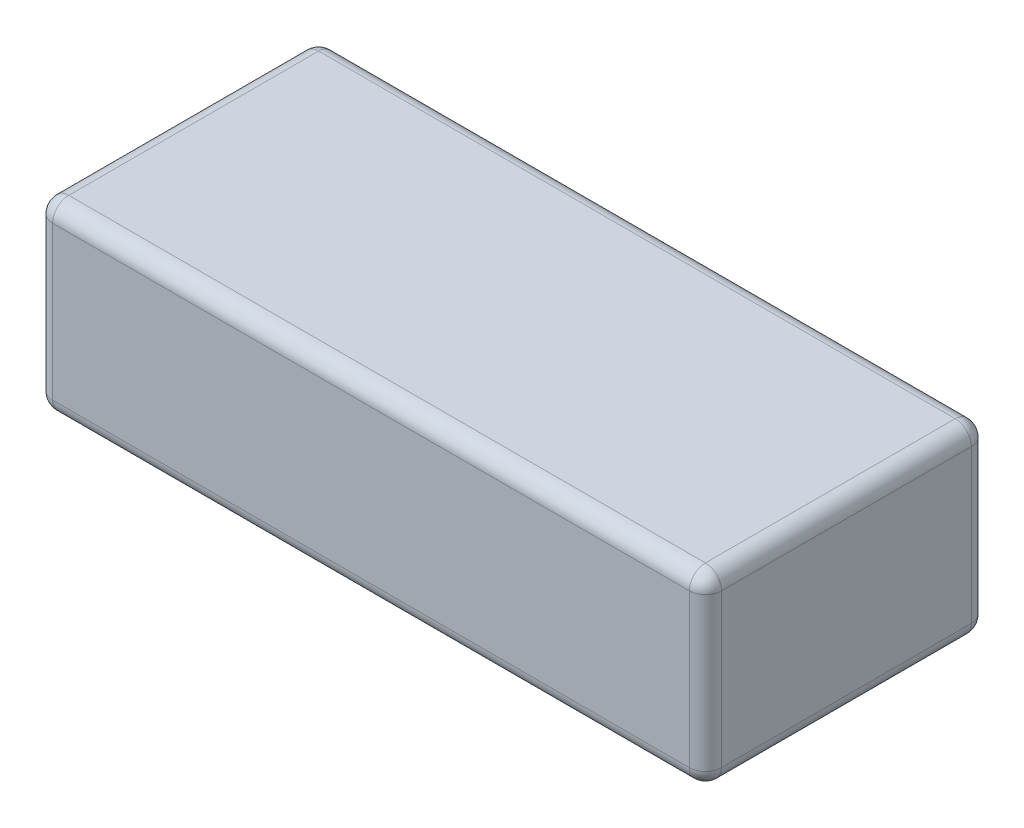
ISO-10303-21;
HEADER;
FILE_DESCRIPTION(('STEP AP214'),'2;1');
FILE_NAME('part.step','',(''),(''),'','','');
FILE_SCHEMA(('AUTOMOTIVE_DESIGN { 1 0 10303 214 1 1 1 1 }'));
ENDSEC;
DATA;
#1=APPLICATION_CONTEXT('core data for automotive mechanical design processes');
#2=APPLICATION_PROTOCOL_DEFINITION('international standard','automotive_design',2000,#1);
#3=PRODUCT_CONTEXT('',#1,'mechanical');
#4=PRODUCT('Part','Part','',(#3));
#5=PRODUCT_RELATED_PRODUCT_CATEGORY('part','',(#4));
#6=PRODUCT_DEFINITION_FORMATION('','',#4);
#7=PRODUCT_DEFINITION_CONTEXT('part definition',#1,'design');
#8=PRODUCT_DEFINITION('design','',#6,#7);
#9=PRODUCT_DEFINITION_SHAPE('','',#8);
#10=(LENGTH_UNIT() NAMED_UNIT(*) SI_UNIT(.MILLI.,.METRE.));
#11=(NAMED_UNIT(*) PLANE_ANGLE_UNIT() SI_UNIT($,.RADIAN.));
#12=(NAMED_UNIT(*) SI_UNIT($,.STERADIAN.) SOLID_ANGLE_UNIT());
#13=UNCERTAINTY_MEASURE_WITH_UNIT(LENGTH_MEASURE(1.E-05),#10,'distance_accuracy_value','');
#14=(GEOMETRIC_REPRESENTATION_CONTEXT(3) GLOBAL_UNCERTAINTY_ASSIGNED_CONTEXT((#13)) GLOBAL_UNIT_ASSIGNED_CONTEXT((#10,
#11,#12)) REPRESENTATION_CONTEXT('',''));
#15=CARTESIAN_POINT('',(0.,0.,0.));
#16=DIRECTION('',(0.,0.,1.));
#17=DIRECTION('',(1.,0.,0.));
#18=AXIS2_PLACEMENT_3D('',#15,#16,#17);
#19=CARTESIAN_POINT('',(41.5,23.,17.5));
#20=DIRECTION('',(-1.,0.,0.));
#21=DIRECTION('',(0.,0.,1.));
#22=AXIS2_PLACEMENT_3D('',#19,#20,#21);
#23=PLANE('',#22);
#24=DIRECTION('',(0.,-1.,0.));
#25=VECTOR('',#24,1.);
#26=CARTESIAN_POINT('',(41.5,23.,15.5));
#27=LINE('',#26,#25);
#28=CARTESIAN_POINT('',(41.5,21.,15.5));
#29=VERTEX_POINT('',#28);
#30=CARTESIAN_POINT('',(41.5,2.,15.5));
#31=VERTEX_POINT('',#30);
#32=EDGE_CURVE('E159',#29,#31,#27,.T.);
#33=ORIENTED_EDGE('',*,*,#32,.T.);
#34=DIRECTION('',(0.,0.,-1.));
#35=VECTOR('',#34,1.);
#36=CARTESIAN_POINT('',(41.5,2.,-17.5));
#37=LINE('',#36,#35);
#38=CARTESIAN_POINT('',(41.5,2.,-15.5));
#39=VERTEX_POINT('',#38);
#40=EDGE_CURVE('E132',#31,#39,#37,.T.);
#41=ORIENTED_EDGE('',*,*,#40,.T.);
#42=DIRECTION('',(0.,-1.,0.));
#43=VECTOR('',#42,1.);
#44=CARTESIAN_POINT('',(41.5,23.,-15.5));
#45=LINE('',#44,#43);
#46=CARTESIAN_POINT('',(41.5,21.,-15.5));
#47=VERTEX_POINT('',#46);
#48=EDGE_CURVE('E150',#39,#47,#45,.F.);
#49=ORIENTED_EDGE('',*,*,#48,.T.);
#50=DIRECTION('',(0.,0.,-1.));
#51=VECTOR('',#50,1.);
#52=CARTESIAN_POINT('',(41.5,21.,17.5));
#53=LINE('',#52,#51);
#54=EDGE_CURVE('E156',#47,#29,#53,.F.);
#55=ORIENTED_EDGE('',*,*,#54,.T.);
#56=EDGE_LOOP('',(#33,#41,#49,#55));
#57=FACE_BOUND('',#56,.T.);
#58=ADVANCED_FACE('F34',(#57),#23,.F.);
#59=CARTESIAN_POINT('',(-41.5,23.,-17.5));
#60=DIRECTION('',(0.,0.,1.));
#61=DIRECTION('',(1.,0.,0.));
#62=AXIS2_PLACEMENT_3D('',#59,#60,#61);
#63=PLANE('',#62);
#64=DIRECTION('',(-1.,0.,0.));
#65=VECTOR('',#64,1.);
#66=CARTESIAN_POINT('',(-41.5,21.,-17.5));
#67=LINE('',#66,#65);
#68=CARTESIAN_POINT('',(-39.5,21.,-17.5));
#69=VERTEX_POINT('',#68);
#70=CARTESIAN_POINT('',(39.5,21.,-17.5));
#71=VERTEX_POINT('',#70);
#72=EDGE_CURVE('E194',#69,#71,#67,.F.);
#73=ORIENTED_EDGE('',*,*,#72,.T.);
#74=DIRECTION('',(0.,-1.,0.));
#75=VECTOR('',#74,1.);
#76=CARTESIAN_POINT('',(39.5,23.,-17.5));
#77=LINE('',#76,#75);
#78=CARTESIAN_POINT('',(39.5,2.,-17.5));
#79=VERTEX_POINT('',#78);
#80=EDGE_CURVE('E196',#71,#79,#77,.T.);
#81=ORIENTED_EDGE('',*,*,#80,.T.);
#82=DIRECTION('',(-1.,0.,0.));
#83=VECTOR('',#82,1.);
#84=CARTESIAN_POINT('',(-41.5,2.,-17.5));
#85=LINE('',#84,#83);
#86=CARTESIAN_POINT('',(-39.5,2.,-17.5));
#87=VERTEX_POINT('',#86);
#88=EDGE_CURVE('E192',#79,#87,#85,.T.);
#89=ORIENTED_EDGE('',*,*,#88,.T.);
#90=DIRECTION('',(0.,-1.,0.));
#91=VECTOR('',#90,1.);
#92=CARTESIAN_POINT('',(-39.5,23.,-17.5));
#93=LINE('',#92,#91);
#94=EDGE_CURVE('E190',#87,#69,#93,.F.);
#95=ORIENTED_EDGE('',*,*,#94,.T.);
#96=EDGE_LOOP('',(#73,#81,#89,#95));
#97=FACE_BOUND('',#96,.T.);
#98=ADVANCED_FACE('F327',(#97),#63,.F.);
#99=CARTESIAN_POINT('',(-41.5,23.,17.5));
#100=DIRECTION('',(1.,0.,0.));
#101=DIRECTION('',(0.,0.,-1.));
#102=AXIS2_PLACEMENT_3D('',#99,#100,#101);
#103=PLANE('',#102);
#104=DIRECTION('',(0.,0.,1.));
#105=VECTOR('',#104,1.);
#106=CARTESIAN_POINT('',(-41.5,21.,17.5));
#107=LINE('',#106,#105);
#108=CARTESIAN_POINT('',(-41.5,21.,15.5));
#109=VERTEX_POINT('',#108);
#110=CARTESIAN_POINT('',(-41.5,21.,-15.5));
#111=VERTEX_POINT('',#110);
#112=EDGE_CURVE('E58',#109,#111,#107,.F.);
#113=ORIENTED_EDGE('',*,*,#112,.T.);
#114=DIRECTION('',(0.,-1.,0.));
#115=VECTOR('',#114,1.);
#116=CARTESIAN_POINT('',(-41.5,23.,-15.5));
#117=LINE('',#116,#115);
#118=CARTESIAN_POINT('',(-41.5,2.,-15.5));
#119=VERTEX_POINT('',#118);
#120=EDGE_CURVE('E11',#111,#119,#117,.T.);
#121=ORIENTED_EDGE('',*,*,#120,.T.);
#122=DIRECTION('',(0.,0.,1.));
#123=VECTOR('',#122,1.);
#124=CARTESIAN_POINT('',(-41.5,2.,17.5));
#125=LINE('',#124,#123);
#126=CARTESIAN_POINT('',(-41.5,2.,15.5));
#127=VERTEX_POINT('',#126);
#128=EDGE_CURVE('E43',#119,#127,#125,.T.);
#129=ORIENTED_EDGE('',*,*,#128,.T.);
#130=DIRECTION('',(0.,-1.,0.));
#131=VECTOR('',#130,1.);
#132=CARTESIAN_POINT('',(-41.5,23.,15.5));
#133=LINE('',#132,#131);
#134=EDGE_CURVE('E199',#127,#109,#133,.F.);
#135=ORIENTED_EDGE('',*,*,#134,.T.);
#136=EDGE_LOOP('',(#113,#121,#129,#135));
#137=FACE_BOUND('',#136,.T.);
#138=ADVANCED_FACE('F299',(#137),#103,.F.);
#139=CARTESIAN_POINT('',(-41.5,23.,17.5));
#140=DIRECTION('',(0.,0.,-1.));
#141=DIRECTION('',(-1.,0.,0.));
#142=AXIS2_PLACEMENT_3D('',#139,#140,#141);
#143=PLANE('',#142);
#144=DIRECTION('',(0.,-1.,0.));
#145=VECTOR('',#144,1.);
#146=CARTESIAN_POINT('',(-39.5,23.,17.5));
#147=LINE('',#146,#145);
#148=CARTESIAN_POINT('',(-39.5,21.,17.5));
#149=VERTEX_POINT('',#148);
#150=CARTESIAN_POINT('',(-39.5,2.,17.5));
#151=VERTEX_POINT('',#150);
#152=EDGE_CURVE('E174',#149,#151,#147,.T.);
#153=ORIENTED_EDGE('',*,*,#152,.T.);
#154=DIRECTION('',(1.,0.,0.));
#155=VECTOR('',#154,1.);
#156=CARTESIAN_POINT('',(41.5,2.,17.5));
#157=LINE('',#156,#155);
#158=CARTESIAN_POINT('',(39.5,2.,17.5));
#159=VERTEX_POINT('',#158);
#160=EDGE_CURVE('E179',#151,#159,#157,.T.);
#161=ORIENTED_EDGE('',*,*,#160,.T.);
#162=DIRECTION('',(0.,-1.,0.));
#163=VECTOR('',#162,1.);
#164=CARTESIAN_POINT('',(39.5,23.,17.5));
#165=LINE('',#164,#163);
#166=CARTESIAN_POINT('',(39.5,21.,17.5));
#167=VERTEX_POINT('',#166);
#168=EDGE_CURVE('E176',#159,#167,#165,.F.);
#169=ORIENTED_EDGE('',*,*,#168,.T.);
#170=DIRECTION('',(1.,0.,0.));
#171=VECTOR('',#170,1.);
#172=CARTESIAN_POINT('',(-41.5,21.,17.5));
#173=LINE('',#172,#171);
#174=EDGE_CURVE('E172',#167,#149,#173,.F.);
#175=ORIENTED_EDGE('',*,*,#174,.T.);
#176=EDGE_LOOP('',(#153,#161,#169,#175));
#177=FACE_BOUND('',#176,.T.);
#178=ADVANCED_FACE('F272',(#177),#143,.F.);
#179=CARTESIAN_POINT('',(0.,23.,0.));
#180=DIRECTION('',(0.,-1.,0.));
#181=DIRECTION('',(0.,0.,-1.));
#182=AXIS2_PLACEMENT_3D('',#179,#180,#181);
#183=PLANE('',#182);
#184=DIRECTION('',(1.,0.,0.));
#185=VECTOR('',#184,1.);
#186=CARTESIAN_POINT('',(0.,23.,15.5));
#187=LINE('',#186,#185);
#188=CARTESIAN_POINT('',(-39.5,23.,15.5));
#189=VERTEX_POINT('',#188);
#190=CARTESIAN_POINT('',(39.5,23.,15.5));
#191=VERTEX_POINT('',#190);
#192=EDGE_CURVE('E181',#189,#191,#187,.T.);
#193=ORIENTED_EDGE('',*,*,#192,.T.);
#194=DIRECTION('',(0.,0.,-1.));
#195=VECTOR('',#194,1.);
#196=CARTESIAN_POINT('',(39.5,23.,0.));
#197=LINE('',#196,#195);
#198=CARTESIAN_POINT('',(39.5,23.,-15.5));
#199=VERTEX_POINT('',#198);
#200=EDGE_CURVE('E187',#191,#199,#197,.T.);
#201=ORIENTED_EDGE('',*,*,#200,.T.);
#202=DIRECTION('',(-1.,0.,0.));
#203=VECTOR('',#202,1.);
#204=CARTESIAN_POINT('',(0.,23.,-15.5));
#205=LINE('',#204,#203);
#206=CARTESIAN_POINT('',(-39.5,23.,-15.5));
#207=VERTEX_POINT('',#206);
#208=EDGE_CURVE('E185',#199,#207,#205,.T.);
#209=ORIENTED_EDGE('',*,*,#208,.T.);
#210=DIRECTION('',(0.,0.,1.));
#211=VECTOR('',#210,1.);
#212=CARTESIAN_POINT('',(-39.5,23.,0.));
#213=LINE('',#212,#211);
#214=EDGE_CURVE('E183',#207,#189,#213,.T.);
#215=ORIENTED_EDGE('',*,*,#214,.T.);
#216=EDGE_LOOP('',(#193,#201,#209,#215));
#217=FACE_BOUND('',#216,.T.);
#218=ADVANCED_FACE('F281',(#217),#183,.F.);
#219=CARTESIAN_POINT('',(0.,0.,0.));
#220=DIRECTION('',(0.,-1.,0.));
#221=DIRECTION('',(0.,0.,-1.));
#222=AXIS2_PLACEMENT_3D('',#219,#220,#221);
#223=PLANE('',#222);
#224=DIRECTION('',(-1.,0.,0.));
#225=VECTOR('',#224,1.);
#226=CARTESIAN_POINT('',(41.5,0.,-15.5));
#227=LINE('',#226,#225);
#228=CARTESIAN_POINT('',(-39.5,0.,-15.5));
#229=VERTEX_POINT('',#228);
#230=CARTESIAN_POINT('',(39.5,0.,-15.5));
#231=VERTEX_POINT('',#230);
#232=EDGE_CURVE('E169',#229,#231,#227,.F.);
#233=ORIENTED_EDGE('',*,*,#232,.T.);
#234=DIRECTION('',(0.,0.,-1.));
#235=VECTOR('',#234,1.);
#236=CARTESIAN_POINT('',(39.5,0.,17.5));
#237=LINE('',#236,#235);
#238=CARTESIAN_POINT('',(39.5,0.,15.5));
#239=VERTEX_POINT('',#238);
#240=EDGE_CURVE('E134',#231,#239,#237,.F.);
#241=ORIENTED_EDGE('',*,*,#240,.T.);
#242=DIRECTION('',(1.,0.,0.));
#243=VECTOR('',#242,1.);
#244=CARTESIAN_POINT('',(-41.5,0.,15.5));
#245=LINE('',#244,#243);
#246=CARTESIAN_POINT('',(-39.5,0.,15.5));
#247=VERTEX_POINT('',#246);
#248=EDGE_CURVE('E161',#239,#247,#245,.F.);
#249=ORIENTED_EDGE('',*,*,#248,.T.);
#250=DIRECTION('',(0.,0.,1.));
#251=VECTOR('',#250,1.);
#252=CARTESIAN_POINT('',(-39.5,0.,-17.5));
#253=LINE('',#252,#251);
#254=EDGE_CURVE('E163',#247,#229,#253,.F.);
#255=ORIENTED_EDGE('',*,*,#254,.T.);
#256=EDGE_LOOP('',(#233,#241,#249,#255));
#257=FACE_BOUND('',#256,.T.);
#258=ADVANCED_FACE('F477',(#257),#223,.T.);
#259=CARTESIAN_POINT('',(-39.5,21.,0.));
#260=DIRECTION('',(0.,0.,1.));
#261=DIRECTION('',(1.,0.,0.));
#262=AXIS2_PLACEMENT_3D('',#259,#260,#261);
#263=CYLINDRICAL_SURFACE('',#262,2.);
#264=CARTESIAN_POINT('',(-39.5,21.,15.5));
#265=DIRECTION('',(0.,0.,1.));
#266=DIRECTION('',(1.,0.,0.));
#267=AXIS2_PLACEMENT_3D('',#264,#265,#266);
#268=CIRCLE('',#267,2.);
#269=EDGE_CURVE('E38',#189,#109,#268,.T.);
#270=ORIENTED_EDGE('',*,*,#269,.F.);
#271=ORIENTED_EDGE('',*,*,#214,.F.);
#272=CARTESIAN_POINT('',(-39.5,21.,-15.5));
#273=DIRECTION('',(0.,0.,-1.));
#274=DIRECTION('',(0.,1.,0.));
#275=AXIS2_PLACEMENT_3D('',#272,#273,#274);
#276=CIRCLE('',#275,2.);
#277=EDGE_CURVE('E250',#111,#207,#276,.T.);
#278=ORIENTED_EDGE('',*,*,#277,.F.);
#279=ORIENTED_EDGE('',*,*,#112,.F.);
#280=EDGE_LOOP('',(#270,#271,#278,#279));
#281=FACE_BOUND('',#280,.T.);
#282=ADVANCED_FACE('F36',(#281),#263,.T.);
#283=CARTESIAN_POINT('',(-39.5,21.,15.5));
#284=DIRECTION('',(0.,0.,1.));
#285=DIRECTION('',(1.,0.,0.));
#286=AXIS2_PLACEMENT_3D('',#283,#284,#285);
#287=SPHERICAL_SURFACE('',#286,2.);
#288=CARTESIAN_POINT('',(-39.5,21.,15.5));
#289=DIRECTION('',(-1.,0.,0.));
#290=DIRECTION('',(0.,0.,1.));
#291=AXIS2_PLACEMENT_3D('',#288,#289,#290);
#292=CIRCLE('',#291,2.);
#293=EDGE_CURVE('E245',#189,#149,#292,.F.);
#294=ORIENTED_EDGE('',*,*,#293,.F.);
#295=ORIENTED_EDGE('',*,*,#269,.T.);
#296=CARTESIAN_POINT('',(-39.5,21.,15.5));
#297=DIRECTION('',(0.,1.,0.));
#298=DIRECTION('',(0.,0.,1.));
#299=AXIS2_PLACEMENT_3D('',#296,#297,#298);
#300=CIRCLE('',#299,2.);
#301=EDGE_CURVE('E248',#149,#109,#300,.F.);
#302=ORIENTED_EDGE('',*,*,#301,.F.);
#303=EDGE_LOOP('',(#294,#295,#302));
#304=FACE_BOUND('',#303,.T.);
#305=ADVANCED_FACE('F260',(#304),#287,.T.);
#306=CARTESIAN_POINT('',(-39.5,21.,-15.5));
#307=DIRECTION('',(0.,0.,1.));
#308=DIRECTION('',(1.,0.,0.));
#309=AXIS2_PLACEMENT_3D('',#306,#307,#308);
#310=SPHERICAL_SURFACE('',#309,2.);
#311=CARTESIAN_POINT('',(-39.5,21.,-15.5));
#312=DIRECTION('',(0.,1.,0.));
#313=DIRECTION('',(0.,0.,1.));
#314=AXIS2_PLACEMENT_3D('',#311,#312,#313);
#315=CIRCLE('',#314,2.);
#316=EDGE_CURVE('E239',#111,#69,#315,.F.);
#317=ORIENTED_EDGE('',*,*,#316,.F.);
#318=ORIENTED_EDGE('',*,*,#277,.T.);
#319=CARTESIAN_POINT('',(-39.5,21.,-15.5));
#320=DIRECTION('',(-1.,0.,0.));
#321=DIRECTION('',(0.,0.,1.));
#322=AXIS2_PLACEMENT_3D('',#319,#320,#321);
#323=CIRCLE('',#322,2.);
#324=EDGE_CURVE('E242',#69,#207,#323,.F.);
#325=ORIENTED_EDGE('',*,*,#324,.F.);
#326=EDGE_LOOP('',(#317,#318,#325));
#327=FACE_BOUND('',#326,.T.);
#328=ADVANCED_FACE('F294',(#327),#310,.T.);
#329=CARTESIAN_POINT('',(-39.5,23.,15.5));
#330=DIRECTION('',(0.,-1.,0.));
#331=DIRECTION('',(0.,0.,-1.));
#332=AXIS2_PLACEMENT_3D('',#329,#330,#331);
#333=CYLINDRICAL_SURFACE('',#332,2.);
#334=ORIENTED_EDGE('',*,*,#301,.T.);
#335=ORIENTED_EDGE('',*,*,#134,.F.);
#336=CARTESIAN_POINT('',(-39.5,2.,15.5));
#337=DIRECTION('',(0.,-1.,0.));
#338=DIRECTION('',(0.,0.,-1.));
#339=AXIS2_PLACEMENT_3D('',#336,#337,#338);
#340=CIRCLE('',#339,2.);
#341=EDGE_CURVE('E233',#151,#127,#340,.T.);
#342=ORIENTED_EDGE('',*,*,#341,.F.);
#343=ORIENTED_EDGE('',*,*,#152,.F.);
#344=EDGE_LOOP('',(#334,#335,#342,#343));
#345=FACE_BOUND('',#344,.T.);
#346=ADVANCED_FACE('F267',(#345),#333,.T.);
#347=CARTESIAN_POINT('',(0.,21.,15.5));
#348=DIRECTION('',(1.,0.,0.));
#349=DIRECTION('',(0.,0.,-1.));
#350=AXIS2_PLACEMENT_3D('',#347,#348,#349);
#351=CYLINDRICAL_SURFACE('',#350,2.);
#352=ORIENTED_EDGE('',*,*,#293,.T.);
#353=ORIENTED_EDGE('',*,*,#174,.F.);
#354=CARTESIAN_POINT('',(39.5,21.,15.5));
#355=DIRECTION('',(1.,0.,0.));
#356=DIRECTION('',(0.,0.,-1.));
#357=AXIS2_PLACEMENT_3D('',#354,#355,#356);
#358=CIRCLE('',#357,2.);
#359=EDGE_CURVE('E230',#191,#167,#358,.T.);
#360=ORIENTED_EDGE('',*,*,#359,.F.);
#361=ORIENTED_EDGE('',*,*,#192,.F.);
#362=EDGE_LOOP('',(#352,#353,#360,#361));
#363=FACE_BOUND('',#362,.T.);
#364=ADVANCED_FACE('F278',(#363),#351,.T.);
#365=CARTESIAN_POINT('',(39.5,21.,0.));
#366=DIRECTION('',(0.,0.,-1.));
#367=DIRECTION('',(-1.,0.,0.));
#368=AXIS2_PLACEMENT_3D('',#365,#366,#367);
#369=CYLINDRICAL_SURFACE('',#368,2.);
#370=CARTESIAN_POINT('',(39.5,21.,-15.5));
#371=DIRECTION('',(0.,0.,-1.));
#372=DIRECTION('',(-1.,0.,0.));
#373=AXIS2_PLACEMENT_3D('',#370,#371,#372);
#374=CIRCLE('',#373,2.);
#375=EDGE_CURVE('E224',#199,#47,#374,.T.);
#376=ORIENTED_EDGE('',*,*,#375,.F.);
#377=ORIENTED_EDGE('',*,*,#200,.F.);
#378=CARTESIAN_POINT('',(39.5,21.,15.5));
#379=DIRECTION('',(0.,0.,1.));
#380=DIRECTION('',(1.,0.,0.));
#381=AXIS2_PLACEMENT_3D('',#378,#379,#380);
#382=CIRCLE('',#381,2.);
#383=EDGE_CURVE('E227',#29,#191,#382,.T.);
#384=ORIENTED_EDGE('',*,*,#383,.F.);
#385=ORIENTED_EDGE('',*,*,#54,.F.);
#386=EDGE_LOOP('',(#376,#377,#384,#385));
#387=FACE_BOUND('',#386,.T.);
#388=ADVANCED_FACE('F285',(#387),#369,.T.);
#389=CARTESIAN_POINT('',(0.,21.,-15.5));
#390=DIRECTION('',(-1.,0.,0.));
#391=DIRECTION('',(0.,0.,1.));
#392=AXIS2_PLACEMENT_3D('',#389,#390,#391);
#393=CYLINDRICAL_SURFACE('',#392,2.);
#394=ORIENTED_EDGE('',*,*,#324,.T.);
#395=ORIENTED_EDGE('',*,*,#208,.F.);
#396=CARTESIAN_POINT('',(39.5,21.,-15.5));
#397=DIRECTION('',(1.,0.,0.));
#398=DIRECTION('',(0.,0.,-1.));
#399=AXIS2_PLACEMENT_3D('',#396,#397,#398);
#400=CIRCLE('',#399,2.);
#401=EDGE_CURVE('E222',#71,#199,#400,.T.);
#402=ORIENTED_EDGE('',*,*,#401,.F.);
#403=ORIENTED_EDGE('',*,*,#72,.F.);
#404=EDGE_LOOP('',(#394,#395,#402,#403));
#405=FACE_BOUND('',#404,.T.);
#406=ADVANCED_FACE('F291',(#405),#393,.T.);
#407=CARTESIAN_POINT('',(-39.5,23.,-15.5));
#408=DIRECTION('',(0.,-1.,0.));
#409=DIRECTION('',(0.,0.,-1.));
#410=AXIS2_PLACEMENT_3D('',#407,#408,#409);
#411=CYLINDRICAL_SURFACE('',#410,2.);
#412=ORIENTED_EDGE('',*,*,#316,.T.);
#413=ORIENTED_EDGE('',*,*,#94,.F.);
#414=CARTESIAN_POINT('',(-39.5,2.,-15.5));
#415=DIRECTION('',(0.,-1.,0.));
#416=DIRECTION('',(0.,0.,-1.));
#417=AXIS2_PLACEMENT_3D('',#414,#415,#416);
#418=CIRCLE('',#417,2.);
#419=EDGE_CURVE('E220',#119,#87,#418,.T.);
#420=ORIENTED_EDGE('',*,*,#419,.F.);
#421=ORIENTED_EDGE('',*,*,#120,.F.);
#422=EDGE_LOOP('',(#412,#413,#420,#421));
#423=FACE_BOUND('',#422,.T.);
#424=ADVANCED_FACE('F297',(#423),#411,.T.);
#425=CARTESIAN_POINT('',(-39.5,2.,17.5));
#426=DIRECTION('',(0.,0.,-1.));
#427=DIRECTION('',(-1.,0.,0.));
#428=AXIS2_PLACEMENT_3D('',#425,#426,#427);
#429=CYLINDRICAL_SURFACE('',#428,2.);
#430=CARTESIAN_POINT('',(-39.5,2.,15.5));
#431=DIRECTION('',(0.,0.,1.));
#432=DIRECTION('',(1.,0.,0.));
#433=AXIS2_PLACEMENT_3D('',#430,#431,#432);
#434=CIRCLE('',#433,2.);
#435=EDGE_CURVE('E236',#127,#247,#434,.T.);
#436=ORIENTED_EDGE('',*,*,#435,.F.);
#437=ORIENTED_EDGE('',*,*,#128,.F.);
#438=CARTESIAN_POINT('',(-39.5,2.,-15.5));
#439=DIRECTION('',(0.,0.,-1.));
#440=DIRECTION('',(-1.,0.,0.));
#441=AXIS2_PLACEMENT_3D('',#438,#439,#440);
#442=CIRCLE('',#441,2.);
#443=EDGE_CURVE('E51',#229,#119,#442,.T.);
#444=ORIENTED_EDGE('',*,*,#443,.F.);
#445=ORIENTED_EDGE('',*,*,#254,.F.);
#446=EDGE_LOOP('',(#436,#437,#444,#445));
#447=FACE_BOUND('',#446,.T.);
#448=ADVANCED_FACE('F301',(#447),#429,.T.);
#449=CARTESIAN_POINT('',(-39.5,2.,15.5));
#450=DIRECTION('',(0.,0.,1.));
#451=DIRECTION('',(1.,0.,0.));
#452=AXIS2_PLACEMENT_3D('',#449,#450,#451);
#453=SPHERICAL_SURFACE('',#452,2.);
#454=ORIENTED_EDGE('',*,*,#341,.T.);
#455=ORIENTED_EDGE('',*,*,#435,.T.);
#456=CARTESIAN_POINT('',(-39.5,2.,15.5));
#457=DIRECTION('',(-1.,0.,0.));
#458=DIRECTION('',(0.,0.,1.));
#459=AXIS2_PLACEMENT_3D('',#456,#457,#458);
#460=CIRCLE('',#459,2.);
#461=EDGE_CURVE('E216',#151,#247,#460,.F.);
#462=ORIENTED_EDGE('',*,*,#461,.F.);
#463=EDGE_LOOP('',(#454,#455,#462));
#464=FACE_BOUND('',#463,.T.);
#465=ADVANCED_FACE('F304',(#464),#453,.T.);
#466=CARTESIAN_POINT('',(39.5,21.,15.5));
#467=DIRECTION('',(0.,0.,1.));
#468=DIRECTION('',(1.,0.,0.));
#469=AXIS2_PLACEMENT_3D('',#466,#467,#468);
#470=SPHERICAL_SURFACE('',#469,2.);
#471=ORIENTED_EDGE('',*,*,#383,.T.);
#472=ORIENTED_EDGE('',*,*,#359,.T.);
#473=CARTESIAN_POINT('',(39.5,21.,15.5));
#474=DIRECTION('',(0.,1.,0.));
#475=DIRECTION('',(0.,0.,1.));
#476=AXIS2_PLACEMENT_3D('',#473,#474,#475);
#477=CIRCLE('',#476,2.);
#478=EDGE_CURVE('E214',#29,#167,#477,.F.);
#479=ORIENTED_EDGE('',*,*,#478,.F.);
#480=EDGE_LOOP('',(#471,#472,#479));
#481=FACE_BOUND('',#480,.T.);
#482=ADVANCED_FACE('F315',(#481),#470,.T.);
#483=CARTESIAN_POINT('',(39.5,21.,-15.5));
#484=DIRECTION('',(0.,0.,1.));
#485=DIRECTION('',(1.,0.,0.));
#486=AXIS2_PLACEMENT_3D('',#483,#484,#485);
#487=SPHERICAL_SURFACE('',#486,2.);
#488=ORIENTED_EDGE('',*,*,#401,.T.);
#489=ORIENTED_EDGE('',*,*,#375,.T.);
#490=CARTESIAN_POINT('',(39.5,21.,-15.5));
#491=DIRECTION('',(0.,1.,0.));
#492=DIRECTION('',(0.,0.,1.));
#493=AXIS2_PLACEMENT_3D('',#490,#491,#492);
#494=CIRCLE('',#493,2.);
#495=EDGE_CURVE('E153',#71,#47,#494,.F.);
#496=ORIENTED_EDGE('',*,*,#495,.F.);
#497=EDGE_LOOP('',(#488,#489,#496));
#498=FACE_BOUND('',#497,.T.);
#499=ADVANCED_FACE('F317',(#498),#487,.T.);
#500=CARTESIAN_POINT('',(-39.5,2.,-15.5));
#501=DIRECTION('',(0.,0.,1.));
#502=DIRECTION('',(1.,0.,0.));
#503=AXIS2_PLACEMENT_3D('',#500,#501,#502);
#504=SPHERICAL_SURFACE('',#503,2.);
#505=ORIENTED_EDGE('',*,*,#443,.T.);
#506=ORIENTED_EDGE('',*,*,#419,.T.);
#507=CARTESIAN_POINT('',(-39.5,2.,-15.5));
#508=DIRECTION('',(-1.,0.,0.));
#509=DIRECTION('',(0.,0.,1.));
#510=AXIS2_PLACEMENT_3D('',#507,#508,#509);
#511=CIRCLE('',#510,2.);
#512=EDGE_CURVE('E210',#229,#87,#511,.F.);
#513=ORIENTED_EDGE('',*,*,#512,.F.);
#514=EDGE_LOOP('',(#505,#506,#513));
#515=FACE_BOUND('',#514,.T.);
#516=ADVANCED_FACE('F323',(#515),#504,.T.);
#517=CARTESIAN_POINT('',(-41.5,2.,15.5));
#518=DIRECTION('',(-1.,0.,0.));
#519=DIRECTION('',(0.,0.,1.));
#520=AXIS2_PLACEMENT_3D('',#517,#518,#519);
#521=CYLINDRICAL_SURFACE('',#520,2.);
#522=ORIENTED_EDGE('',*,*,#461,.T.);
#523=ORIENTED_EDGE('',*,*,#248,.F.);
#524=CARTESIAN_POINT('',(39.5,2.,15.5));
#525=DIRECTION('',(1.,0.,0.));
#526=DIRECTION('',(0.,0.,-1.));
#527=AXIS2_PLACEMENT_3D('',#524,#525,#526);
#528=CIRCLE('',#527,2.);
#529=EDGE_CURVE('E207',#159,#239,#528,.T.);
#530=ORIENTED_EDGE('',*,*,#529,.F.);
#531=ORIENTED_EDGE('',*,*,#160,.F.);
#532=EDGE_LOOP('',(#522,#523,#530,#531));
#533=FACE_BOUND('',#532,.T.);
#534=ADVANCED_FACE('F308',(#533),#521,.T.);
#535=CARTESIAN_POINT('',(39.5,23.,15.5));
#536=DIRECTION('',(0.,-1.,0.));
#537=DIRECTION('',(0.,0.,-1.));
#538=AXIS2_PLACEMENT_3D('',#535,#536,#537);
#539=CYLINDRICAL_SURFACE('',#538,2.);
#540=ORIENTED_EDGE('',*,*,#478,.T.);
#541=ORIENTED_EDGE('',*,*,#168,.F.);
#542=CARTESIAN_POINT('',(39.5,2.,15.5));
#543=DIRECTION('',(0.,-1.,0.));
#544=DIRECTION('',(0.,0.,-1.));
#545=AXIS2_PLACEMENT_3D('',#542,#543,#544);
#546=CIRCLE('',#545,2.);
#547=EDGE_CURVE('E147',#31,#159,#546,.T.);
#548=ORIENTED_EDGE('',*,*,#547,.F.);
#549=ORIENTED_EDGE('',*,*,#32,.F.);
#550=EDGE_LOOP('',(#540,#541,#548,#549));
#551=FACE_BOUND('',#550,.T.);
#552=ADVANCED_FACE('F313',(#551),#539,.T.);
#553=CARTESIAN_POINT('',(39.5,23.,-15.5));
#554=DIRECTION('',(0.,-1.,0.));
#555=DIRECTION('',(0.,0.,-1.));
#556=AXIS2_PLACEMENT_3D('',#553,#554,#555);
#557=CYLINDRICAL_SURFACE('',#556,2.);
#558=ORIENTED_EDGE('',*,*,#495,.T.);
#559=ORIENTED_EDGE('',*,*,#48,.F.);
#560=CARTESIAN_POINT('',(39.5,2.,-15.5));
#561=DIRECTION('',(0.,-1.,0.));
#562=DIRECTION('',(0.,0.,-1.));
#563=AXIS2_PLACEMENT_3D('',#560,#561,#562);
#564=CIRCLE('',#563,2.);
#565=EDGE_CURVE('E139',#79,#39,#564,.T.);
#566=ORIENTED_EDGE('',*,*,#565,.F.);
#567=ORIENTED_EDGE('',*,*,#80,.F.);
#568=EDGE_LOOP('',(#558,#559,#566,#567));
#569=FACE_BOUND('',#568,.T.);
#570=ADVANCED_FACE('F151',(#569),#557,.T.);
#571=CARTESIAN_POINT('',(-41.5,2.,-15.5));
#572=DIRECTION('',(1.,0.,0.));
#573=DIRECTION('',(0.,0.,-1.));
#574=AXIS2_PLACEMENT_3D('',#571,#572,#573);
#575=CYLINDRICAL_SURFACE('',#574,2.);
#576=ORIENTED_EDGE('',*,*,#512,.T.);
#577=ORIENTED_EDGE('',*,*,#88,.F.);
#578=CARTESIAN_POINT('',(39.5,2.,-15.5));
#579=DIRECTION('',(1.,0.,0.));
#580=DIRECTION('',(0.,0.,-1.));
#581=AXIS2_PLACEMENT_3D('',#578,#579,#580);
#582=CIRCLE('',#581,2.);
#583=EDGE_CURVE('E143',#231,#79,#582,.T.);
#584=ORIENTED_EDGE('',*,*,#583,.F.);
#585=ORIENTED_EDGE('',*,*,#232,.F.);
#586=EDGE_LOOP('',(#576,#577,#584,#585));
#587=FACE_BOUND('',#586,.T.);
#588=ADVANCED_FACE('F342',(#587),#575,.T.);
#589=CARTESIAN_POINT('',(39.5,2.,15.5));
#590=DIRECTION('',(0.,0.,1.));
#591=DIRECTION('',(1.,0.,0.));
#592=AXIS2_PLACEMENT_3D('',#589,#590,#591);
#593=SPHERICAL_SURFACE('',#592,2.);
#594=ORIENTED_EDGE('',*,*,#547,.T.);
#595=ORIENTED_EDGE('',*,*,#529,.T.);
#596=CARTESIAN_POINT('',(39.5,2.,15.5));
#597=DIRECTION('',(0.,0.,1.));
#598=DIRECTION('',(1.,0.,0.));
#599=AXIS2_PLACEMENT_3D('',#596,#597,#598);
#600=CIRCLE('',#599,2.);
#601=EDGE_CURVE('E136',#31,#239,#600,.F.);
#602=ORIENTED_EDGE('',*,*,#601,.F.);
#603=EDGE_LOOP('',(#594,#595,#602));
#604=FACE_BOUND('',#603,.T.);
#605=ADVANCED_FACE('F311',(#604),#593,.T.);
#606=CARTESIAN_POINT('',(39.5,2.,-15.5));
#607=DIRECTION('',(0.,0.,1.));
#608=DIRECTION('',(1.,0.,0.));
#609=AXIS2_PLACEMENT_3D('',#606,#607,#608);
#610=SPHERICAL_SURFACE('',#609,2.);
#611=ORIENTED_EDGE('',*,*,#583,.T.);
#612=ORIENTED_EDGE('',*,*,#565,.T.);
#613=CARTESIAN_POINT('',(39.5,2.,-15.5));
#614=DIRECTION('',(0.,0.,-1.));
#615=DIRECTION('',(-1.,0.,0.));
#616=AXIS2_PLACEMENT_3D('',#613,#614,#615);
#617=CIRCLE('',#616,2.);
#618=EDGE_CURVE('E128',#231,#39,#617,.F.);
#619=ORIENTED_EDGE('',*,*,#618,.F.);
#620=EDGE_LOOP('',(#611,#612,#619));
#621=FACE_BOUND('',#620,.T.);
#622=ADVANCED_FACE('F141',(#621),#610,.T.);
#623=CARTESIAN_POINT('',(39.5,2.,17.5));
#624=DIRECTION('',(0.,0.,1.));
#625=DIRECTION('',(1.,0.,0.));
#626=AXIS2_PLACEMENT_3D('',#623,#624,#625);
#627=CYLINDRICAL_SURFACE('',#626,2.);
#628=ORIENTED_EDGE('',*,*,#601,.T.);
#629=ORIENTED_EDGE('',*,*,#240,.F.);
#630=ORIENTED_EDGE('',*,*,#618,.T.);
#631=ORIENTED_EDGE('',*,*,#40,.F.);
#632=EDGE_LOOP('',(#628,#629,#630,#631));
#633=FACE_BOUND('',#632,.T.);
#634=ADVANCED_FACE('F130',(#633),#627,.T.);
#635=CLOSED_SHELL('',(#58,#98,#138,#178,#218,#258,#282,#305,#328,#346,#364,#388,#406,#424,#448,
#465,#482,#499,#516,#534,#552,#570,#588,#605,#622,#634));
#636=MANIFOLD_SOLID_BREP('B2',#635);
#637=ADVANCED_BREP_SHAPE_REPRESENTATION('',(#18,#636),#14);
#638=SHAPE_DEFINITION_REPRESENTATION(#9,#637);
ENDSEC;
END-ISO-10303-21;
